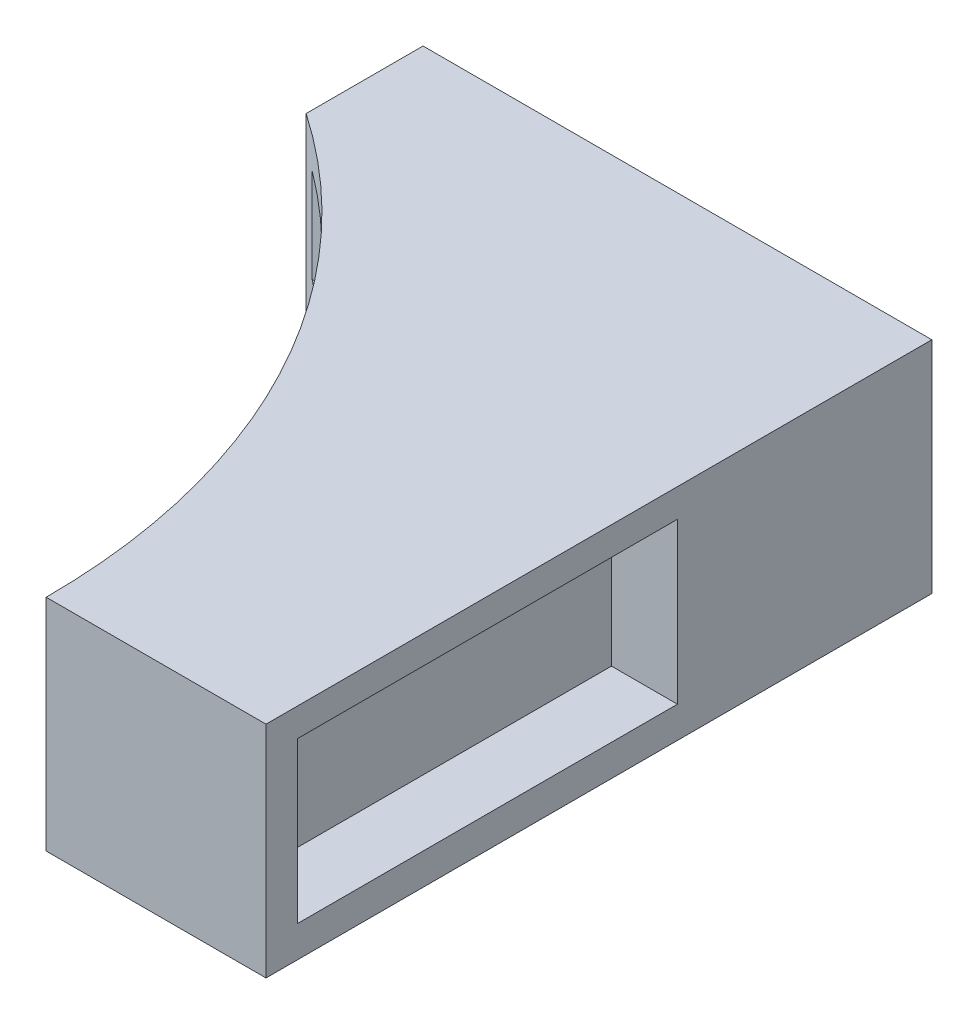
ISO-10303-21;
HEADER;
FILE_DESCRIPTION(('STEP AP214'),'2;1');
FILE_NAME('part.step','',(''),(''),'','','');
FILE_SCHEMA(('AUTOMOTIVE_DESIGN { 1 0 10303 214 1 1 1 1 }'));
ENDSEC;
DATA;
#1=APPLICATION_CONTEXT('core data for automotive mechanical design processes');
#2=APPLICATION_PROTOCOL_DEFINITION('international standard','automotive_design',2000,#1);
#3=PRODUCT_CONTEXT('',#1,'mechanical');
#4=PRODUCT('Part','Part','',(#3));
#5=PRODUCT_RELATED_PRODUCT_CATEGORY('part','',(#4));
#6=PRODUCT_DEFINITION_FORMATION('','',#4);
#7=PRODUCT_DEFINITION_CONTEXT('part definition',#1,'design');
#8=PRODUCT_DEFINITION('design','',#6,#7);
#9=PRODUCT_DEFINITION_SHAPE('','',#8);
#10=(LENGTH_UNIT() NAMED_UNIT(*) SI_UNIT(.MILLI.,.METRE.));
#11=(NAMED_UNIT(*) PLANE_ANGLE_UNIT() SI_UNIT($,.RADIAN.));
#12=(NAMED_UNIT(*) SI_UNIT($,.STERADIAN.) SOLID_ANGLE_UNIT());
#13=UNCERTAINTY_MEASURE_WITH_UNIT(LENGTH_MEASURE(1.E-05),#10,'distance_accuracy_value','');
#14=(GEOMETRIC_REPRESENTATION_CONTEXT(3) GLOBAL_UNCERTAINTY_ASSIGNED_CONTEXT((#13)) GLOBAL_UNIT_ASSIGNED_CONTEXT((#10,
#11,#12)) REPRESENTATION_CONTEXT('',''));
#15=CARTESIAN_POINT('',(0.,0.,0.));
#16=DIRECTION('',(0.,0.,1.));
#17=DIRECTION('',(1.,0.,0.));
#18=AXIS2_PLACEMENT_3D('',#15,#16,#17);
#19=CARTESIAN_POINT('',(-21.2,7.,0.));
#20=DIRECTION('',(0.,-1.,0.));
#21=DIRECTION('',(0.,0.,-1.));
#22=AXIS2_PLACEMENT_3D('',#19,#20,#21);
#23=CYLINDRICAL_SURFACE('',#22,21.2);
#24=CARTESIAN_POINT('',(-21.2,3.,0.));
#25=DIRECTION('',(0.,-1.,0.));
#26=DIRECTION('',(0.,0.,-1.));
#27=AXIS2_PLACEMENT_3D('',#24,#25,#26);
#28=CIRCLE('',#27,21.2);
#29=CARTESIAN_POINT('',(-0.0945504667633247,3.,-2.));
#30=VERTEX_POINT('',#29);
#31=CARTESIAN_POINT('',(-8.5335087731448,3.,-17.));
#32=VERTEX_POINT('',#31);
#33=EDGE_CURVE('E51',#30,#32,#28,.F.);
#34=ORIENTED_EDGE('',*,*,#33,.T.);
#35=DIRECTION('',(0.,-1.,0.));
#36=VECTOR('',#35,1.);
#37=CARTESIAN_POINT('',(-8.5335087731448,7.,-17.));
#38=LINE('',#37,#36);
#39=CARTESIAN_POINT('',(-8.5335087731448,6.,-17.));
#40=VERTEX_POINT('',#39);
#41=EDGE_CURVE('E11',#32,#40,#38,.F.);
#42=ORIENTED_EDGE('',*,*,#41,.T.);
#43=CARTESIAN_POINT('',(-21.2,6.,0.));
#44=DIRECTION('',(0.,1.,0.));
#45=DIRECTION('',(0.,0.,1.));
#46=AXIS2_PLACEMENT_3D('',#43,#44,#45);
#47=CIRCLE('',#46,21.2);
#48=CARTESIAN_POINT('',(-0.0945504667633247,6.,-2.));
#49=VERTEX_POINT('',#48);
#50=EDGE_CURVE('E266',#40,#49,#47,.F.);
#51=ORIENTED_EDGE('',*,*,#50,.T.);
#52=DIRECTION('',(0.,-1.,0.));
#53=VECTOR('',#52,1.);
#54=CARTESIAN_POINT('',(-0.0945504667633247,7.,-2.));
#55=LINE('',#54,#53);
#56=EDGE_CURVE('E270',#49,#30,#55,.T.);
#57=ORIENTED_EDGE('',*,*,#56,.T.);
#58=EDGE_LOOP('',(#34,#42,#51,#57));
#59=FACE_BOUND('',#58,.T.);
#60=CARTESIAN_POINT('',(-21.2,7.,0.));
#61=DIRECTION('',(0.,-1.,0.));
#62=DIRECTION('',(0.,0.,-1.));
#63=AXIS2_PLACEMENT_3D('',#60,#61,#62);
#64=CIRCLE('',#63,21.2);
#65=CARTESIAN_POINT('',(-9.2,7.,-17.4768418199628));
#66=VERTEX_POINT('',#65);
#67=CARTESIAN_POINT('',(0.,7.,0.));
#68=VERTEX_POINT('',#67);
#69=EDGE_CURVE('E229',#66,#68,#64,.T.);
#70=ORIENTED_EDGE('',*,*,#69,.F.);
#71=DIRECTION('',(0.,1.,0.));
#72=VECTOR('',#71,1.);
#73=CARTESIAN_POINT('',(-9.2,0.,-17.4768418199628));
#74=LINE('',#73,#72);
#75=CARTESIAN_POINT('',(-9.2,0.,-17.4768418199628));
#76=VERTEX_POINT('',#75);
#77=EDGE_CURVE('E219',#76,#66,#74,.T.);
#78=ORIENTED_EDGE('',*,*,#77,.F.);
#79=CARTESIAN_POINT('',(-21.2,0.,0.));
#80=DIRECTION('',(0.,-1.,0.));
#81=DIRECTION('',(0.,0.,-1.));
#82=AXIS2_PLACEMENT_3D('',#79,#80,#81);
#83=CIRCLE('',#82,21.2);
#84=CARTESIAN_POINT('',(0.,0.,0.));
#85=VERTEX_POINT('',#84);
#86=EDGE_CURVE('E226',#76,#85,#83,.T.);
#87=ORIENTED_EDGE('',*,*,#86,.T.);
#88=DIRECTION('',(0.,-1.,0.));
#89=VECTOR('',#88,1.);
#90=CARTESIAN_POINT('',(0.,7.,0.));
#91=LINE('',#90,#89);
#92=EDGE_CURVE('E262',#68,#85,#91,.T.);
#93=ORIENTED_EDGE('',*,*,#92,.F.);
#94=EDGE_LOOP('',(#70,#78,#87,#93));
#95=FACE_BOUND('',#94,.T.);
#96=ADVANCED_FACE('F43',(#59,#95),#23,.F.);
#97=CARTESIAN_POINT('',(0.,7.,0.));
#98=DIRECTION('',(0.,0.,-1.));
#99=DIRECTION('',(-1.,0.,0.));
#100=AXIS2_PLACEMENT_3D('',#97,#98,#99);
#101=PLANE('',#100);
#102=DIRECTION('',(1.,0.,0.));
#103=VECTOR('',#102,1.);
#104=CARTESIAN_POINT('',(0.,0.,0.));
#105=LINE('',#104,#103);
#106=CARTESIAN_POINT('',(7.,0.,0.));
#107=VERTEX_POINT('',#106);
#108=EDGE_CURVE('E246',#85,#107,#105,.T.);
#109=ORIENTED_EDGE('',*,*,#108,.T.);
#110=DIRECTION('',(0.,-1.,0.));
#111=VECTOR('',#110,1.);
#112=CARTESIAN_POINT('',(7.,7.,0.));
#113=LINE('',#112,#111);
#114=CARTESIAN_POINT('',(7.,7.,0.));
#115=VERTEX_POINT('',#114);
#116=EDGE_CURVE('E258',#115,#107,#113,.T.);
#117=ORIENTED_EDGE('',*,*,#116,.F.);
#118=DIRECTION('',(1.,0.,0.));
#119=VECTOR('',#118,1.);
#120=CARTESIAN_POINT('',(0.,7.,0.));
#121=LINE('',#120,#119);
#122=EDGE_CURVE('E232',#68,#115,#121,.T.);
#123=ORIENTED_EDGE('',*,*,#122,.F.);
#124=ORIENTED_EDGE('',*,*,#92,.T.);
#125=EDGE_LOOP('',(#109,#117,#123,#124));
#126=FACE_BOUND('',#125,.T.);
#127=ADVANCED_FACE('F303',(#126),#101,.F.);
#128=CARTESIAN_POINT('',(7.,7.,0.));
#129=DIRECTION('',(-1.,0.,0.));
#130=DIRECTION('',(0.,0.,1.));
#131=AXIS2_PLACEMENT_3D('',#128,#129,#130);
#132=PLANE('',#131);
#133=DIRECTION('',(0.,0.,-1.));
#134=VECTOR('',#133,1.);
#135=CARTESIAN_POINT('',(7.,1.,-1.));
#136=LINE('',#135,#134);
#137=CARTESIAN_POINT('',(7.,1.,-1.));
#138=VERTEX_POINT('',#137);
#139=CARTESIAN_POINT('',(7.,1.,-13.1));
#140=VERTEX_POINT('',#139);
#141=EDGE_CURVE('E174',#138,#140,#136,.T.);
#142=ORIENTED_EDGE('',*,*,#141,.F.);
#143=DIRECTION('',(0.,-1.,0.));
#144=VECTOR('',#143,1.);
#145=CARTESIAN_POINT('',(7.,1.,-1.));
#146=LINE('',#145,#144);
#147=CARTESIAN_POINT('',(7.,6.1,-1.));
#148=VERTEX_POINT('',#147);
#149=EDGE_CURVE('E58',#148,#138,#146,.T.);
#150=ORIENTED_EDGE('',*,*,#149,.F.);
#151=DIRECTION('',(0.,0.,1.));
#152=VECTOR('',#151,1.);
#153=CARTESIAN_POINT('',(7.,6.1,-1.));
#154=LINE('',#153,#152);
#155=CARTESIAN_POINT('',(7.,6.1,-13.1));
#156=VERTEX_POINT('',#155);
#157=EDGE_CURVE('E161',#156,#148,#154,.T.);
#158=ORIENTED_EDGE('',*,*,#157,.F.);
#159=DIRECTION('',(0.,1.,0.));
#160=VECTOR('',#159,1.);
#161=CARTESIAN_POINT('',(7.,1.,-13.1));
#162=LINE('',#161,#160);
#163=EDGE_CURVE('E165',#140,#156,#162,.T.);
#164=ORIENTED_EDGE('',*,*,#163,.F.);
#165=EDGE_LOOP('',(#142,#150,#158,#164));
#166=FACE_BOUND('',#165,.T.);
#167=DIRECTION('',(0.,0.,-1.));
#168=VECTOR('',#167,1.);
#169=CARTESIAN_POINT('',(7.,0.,0.));
#170=LINE('',#169,#168);
#171=CARTESIAN_POINT('',(7.,0.,-21.2));
#172=VERTEX_POINT('',#171);
#173=EDGE_CURVE('E249',#107,#172,#170,.T.);
#174=ORIENTED_EDGE('',*,*,#173,.T.);
#175=DIRECTION('',(0.,-1.,0.));
#176=VECTOR('',#175,1.);
#177=CARTESIAN_POINT('',(7.,7.,-21.2));
#178=LINE('',#177,#176);
#179=CARTESIAN_POINT('',(7.,7.,-21.2));
#180=VERTEX_POINT('',#179);
#181=EDGE_CURVE('E243',#180,#172,#178,.T.);
#182=ORIENTED_EDGE('',*,*,#181,.F.);
#183=DIRECTION('',(0.,0.,-1.));
#184=VECTOR('',#183,1.);
#185=CARTESIAN_POINT('',(7.,7.,0.));
#186=LINE('',#185,#184);
#187=EDGE_CURVE('E236',#115,#180,#186,.T.);
#188=ORIENTED_EDGE('',*,*,#187,.F.);
#189=ORIENTED_EDGE('',*,*,#116,.T.);
#190=EDGE_LOOP('',(#174,#182,#188,#189));
#191=FACE_BOUND('',#190,.T.);
#192=ADVANCED_FACE('F307',(#166,#191),#132,.F.);
#193=CARTESIAN_POINT('',(7.,7.,-21.2));
#194=DIRECTION('',(0.,0.,1.));
#195=DIRECTION('',(1.,0.,0.));
#196=AXIS2_PLACEMENT_3D('',#193,#194,#195);
#197=PLANE('',#196);
#198=DIRECTION('',(-1.,0.,0.));
#199=VECTOR('',#198,1.);
#200=CARTESIAN_POINT('',(7.,0.,-21.2));
#201=LINE('',#200,#199);
#202=CARTESIAN_POINT('',(-9.2,0.,-21.2));
#203=VERTEX_POINT('',#202);
#204=EDGE_CURVE('E233',#172,#203,#201,.T.);
#205=ORIENTED_EDGE('',*,*,#204,.T.);
#206=DIRECTION('',(0.,1.,0.));
#207=VECTOR('',#206,1.);
#208=CARTESIAN_POINT('',(-9.2,0.,-21.2));
#209=LINE('',#208,#207);
#210=CARTESIAN_POINT('',(-9.2,7.,-21.2));
#211=VERTEX_POINT('',#210);
#212=EDGE_CURVE('E222',#203,#211,#209,.T.);
#213=ORIENTED_EDGE('',*,*,#212,.T.);
#214=DIRECTION('',(-1.,0.,0.));
#215=VECTOR('',#214,1.);
#216=CARTESIAN_POINT('',(7.,7.,-21.2));
#217=LINE('',#216,#215);
#218=EDGE_CURVE('E239',#180,#211,#217,.T.);
#219=ORIENTED_EDGE('',*,*,#218,.F.);
#220=ORIENTED_EDGE('',*,*,#181,.T.);
#221=EDGE_LOOP('',(#205,#213,#219,#220));
#222=FACE_BOUND('',#221,.T.);
#223=ADVANCED_FACE('F312',(#222),#197,.F.);
#224=CARTESIAN_POINT('',(-21.2,7.,0.));
#225=DIRECTION('',(0.,-1.,0.));
#226=DIRECTION('',(0.,0.,-1.));
#227=AXIS2_PLACEMENT_3D('',#224,#225,#226);
#228=PLANE('',#227);
#229=ORIENTED_EDGE('',*,*,#218,.T.);
#230=DIRECTION('',(0.,0.,-1.));
#231=VECTOR('',#230,1.);
#232=CARTESIAN_POINT('',(-9.2,7.,-17.4768418199628));
#233=LINE('',#232,#231);
#234=EDGE_CURVE('E207',#66,#211,#233,.T.);
#235=ORIENTED_EDGE('',*,*,#234,.F.);
#236=ORIENTED_EDGE('',*,*,#69,.T.);
#237=ORIENTED_EDGE('',*,*,#122,.T.);
#238=ORIENTED_EDGE('',*,*,#187,.T.);
#239=EDGE_LOOP('',(#229,#235,#236,#237,#238));
#240=FACE_BOUND('',#239,.T.);
#241=ADVANCED_FACE('F318',(#240),#228,.F.);
#242=CARTESIAN_POINT('',(-21.2,0.,0.));
#243=DIRECTION('',(0.,-1.,0.));
#244=DIRECTION('',(0.,0.,-1.));
#245=AXIS2_PLACEMENT_3D('',#242,#243,#244);
#246=PLANE('',#245);
#247=DIRECTION('',(0.,0.,-1.));
#248=VECTOR('',#247,1.);
#249=CARTESIAN_POINT('',(-9.2,0.,-17.4768418199628));
#250=LINE('',#249,#248);
#251=EDGE_CURVE('E215',#76,#203,#250,.T.);
#252=ORIENTED_EDGE('',*,*,#251,.T.);
#253=ORIENTED_EDGE('',*,*,#204,.F.);
#254=ORIENTED_EDGE('',*,*,#173,.F.);
#255=ORIENTED_EDGE('',*,*,#108,.F.);
#256=ORIENTED_EDGE('',*,*,#86,.F.);
#257=EDGE_LOOP('',(#252,#253,#254,#255,#256));
#258=FACE_BOUND('',#257,.T.);
#259=ADVANCED_FACE('F320',(#258),#246,.T.);
#260=CARTESIAN_POINT('',(-9.2,0.,-17.4768418199628));
#261=DIRECTION('',(1.,0.,0.));
#262=DIRECTION('',(0.,0.,-1.));
#263=AXIS2_PLACEMENT_3D('',#260,#261,#262);
#264=PLANE('',#263);
#265=ORIENTED_EDGE('',*,*,#234,.T.);
#266=ORIENTED_EDGE('',*,*,#212,.F.);
#267=ORIENTED_EDGE('',*,*,#251,.F.);
#268=ORIENTED_EDGE('',*,*,#77,.T.);
#269=EDGE_LOOP('',(#265,#266,#267,#268));
#270=FACE_BOUND('',#269,.T.);
#271=ADVANCED_FACE('F323',(#270),#264,.F.);
#272=CARTESIAN_POINT('',(-10.,6.,-17.));
#273=DIRECTION('',(0.,0.,-1.));
#274=DIRECTION('',(-1.,0.,0.));
#275=AXIS2_PLACEMENT_3D('',#272,#273,#274);
#276=PLANE('',#275);
#277=DIRECTION('',(1.,0.,0.));
#278=VECTOR('',#277,1.);
#279=CARTESIAN_POINT('',(-10.,3.,-17.));
#280=LINE('',#279,#278);
#281=CARTESIAN_POINT('',(0.,3.,-17.));
#282=VERTEX_POINT('',#281);
#283=EDGE_CURVE('E204',#32,#282,#280,.T.);
#284=ORIENTED_EDGE('',*,*,#283,.T.);
#285=DIRECTION('',(0.,1.,0.));
#286=VECTOR('',#285,1.);
#287=CARTESIAN_POINT('',(0.,6.,-17.));
#288=LINE('',#287,#286);
#289=CARTESIAN_POINT('',(0.,6.,-17.));
#290=VERTEX_POINT('',#289);
#291=EDGE_CURVE('E183',#282,#290,#288,.T.);
#292=ORIENTED_EDGE('',*,*,#291,.T.);
#293=DIRECTION('',(1.,0.,0.));
#294=VECTOR('',#293,1.);
#295=CARTESIAN_POINT('',(-10.,6.,-17.));
#296=LINE('',#295,#294);
#297=EDGE_CURVE('E203',#40,#290,#296,.T.);
#298=ORIENTED_EDGE('',*,*,#297,.F.);
#299=ORIENTED_EDGE('',*,*,#41,.F.);
#300=EDGE_LOOP('',(#284,#292,#298,#299));
#301=FACE_BOUND('',#300,.T.);
#302=ADVANCED_FACE('F291',(#301),#276,.F.);
#303=CARTESIAN_POINT('',(-10.,3.,-17.));
#304=DIRECTION('',(0.,-1.,0.));
#305=DIRECTION('',(0.,0.,-1.));
#306=AXIS2_PLACEMENT_3D('',#303,#304,#305);
#307=PLANE('',#306);
#308=DIRECTION('',(1.,0.,0.));
#309=VECTOR('',#308,1.);
#310=CARTESIAN_POINT('',(-10.,3.,-2.));
#311=LINE('',#310,#309);
#312=CARTESIAN_POINT('',(0.,3.,-2.));
#313=VERTEX_POINT('',#312);
#314=EDGE_CURVE('E208',#30,#313,#311,.T.);
#315=ORIENTED_EDGE('',*,*,#314,.T.);
#316=DIRECTION('',(0.,0.,-1.));
#317=VECTOR('',#316,1.);
#318=CARTESIAN_POINT('',(0.,3.,-17.));
#319=LINE('',#318,#317);
#320=EDGE_CURVE('E199',#313,#282,#319,.T.);
#321=ORIENTED_EDGE('',*,*,#320,.T.);
#322=ORIENTED_EDGE('',*,*,#283,.F.);
#323=ORIENTED_EDGE('',*,*,#33,.F.);
#324=EDGE_LOOP('',(#315,#321,#322,#323));
#325=FACE_BOUND('',#324,.T.);
#326=ADVANCED_FACE('F280',(#325),#307,.F.);
#327=CARTESIAN_POINT('',(-10.,6.,-2.));
#328=DIRECTION('',(0.,0.,1.));
#329=DIRECTION('',(1.,0.,0.));
#330=AXIS2_PLACEMENT_3D('',#327,#328,#329);
#331=PLANE('',#330);
#332=DIRECTION('',(1.,0.,0.));
#333=VECTOR('',#332,1.);
#334=CARTESIAN_POINT('',(-10.,6.,-2.));
#335=LINE('',#334,#333);
#336=CARTESIAN_POINT('',(0.,6.,-2.));
#337=VERTEX_POINT('',#336);
#338=EDGE_CURVE('E66',#49,#337,#335,.T.);
#339=ORIENTED_EDGE('',*,*,#338,.T.);
#340=DIRECTION('',(0.,-1.,0.));
#341=VECTOR('',#340,1.);
#342=CARTESIAN_POINT('',(0.,6.,-2.));
#343=LINE('',#342,#341);
#344=EDGE_CURVE('E195',#337,#313,#343,.T.);
#345=ORIENTED_EDGE('',*,*,#344,.T.);
#346=ORIENTED_EDGE('',*,*,#314,.F.);
#347=ORIENTED_EDGE('',*,*,#56,.F.);
#348=EDGE_LOOP('',(#339,#345,#346,#347));
#349=FACE_BOUND('',#348,.T.);
#350=ADVANCED_FACE('F282',(#349),#331,.F.);
#351=CARTESIAN_POINT('',(-10.,6.,-17.));
#352=DIRECTION('',(0.,1.,0.));
#353=DIRECTION('',(0.,0.,1.));
#354=AXIS2_PLACEMENT_3D('',#351,#352,#353);
#355=PLANE('',#354);
#356=ORIENTED_EDGE('',*,*,#297,.T.);
#357=DIRECTION('',(0.,0.,1.));
#358=VECTOR('',#357,1.);
#359=CARTESIAN_POINT('',(0.,6.,-17.));
#360=LINE('',#359,#358);
#361=EDGE_CURVE('E192',#290,#337,#360,.T.);
#362=ORIENTED_EDGE('',*,*,#361,.T.);
#363=ORIENTED_EDGE('',*,*,#338,.F.);
#364=ORIENTED_EDGE('',*,*,#50,.F.);
#365=EDGE_LOOP('',(#356,#362,#363,#364));
#366=FACE_BOUND('',#365,.T.);
#367=ADVANCED_FACE('F292',(#366),#355,.F.);
#368=CARTESIAN_POINT('',(0.,0.,0.));
#369=DIRECTION('',(-1.,0.,0.));
#370=DIRECTION('',(0.,0.,1.));
#371=AXIS2_PLACEMENT_3D('',#368,#369,#370);
#372=PLANE('',#371);
#373=ORIENTED_EDGE('',*,*,#291,.F.);
#374=ORIENTED_EDGE('',*,*,#320,.F.);
#375=ORIENTED_EDGE('',*,*,#344,.F.);
#376=ORIENTED_EDGE('',*,*,#361,.F.);
#377=EDGE_LOOP('',(#373,#374,#375,#376));
#378=FACE_BOUND('',#377,.T.);
#379=ADVANCED_FACE('F288',(#378),#372,.T.);
#380=CARTESIAN_POINT('',(4.9,1.,-1.));
#381=DIRECTION('',(0.,0.,1.));
#382=DIRECTION('',(0.,-1.,0.));
#383=AXIS2_PLACEMENT_3D('',#380,#381,#382);
#384=PLANE('',#383);
#385=ORIENTED_EDGE('',*,*,#149,.T.);
#386=DIRECTION('',(1.,0.,0.));
#387=VECTOR('',#386,1.);
#388=CARTESIAN_POINT('',(4.9,1.,-1.));
#389=LINE('',#388,#387);
#390=CARTESIAN_POINT('',(4.9,1.,-1.));
#391=VERTEX_POINT('',#390);
#392=EDGE_CURVE('E136',#391,#138,#389,.T.);
#393=ORIENTED_EDGE('',*,*,#392,.F.);
#394=DIRECTION('',(0.,-1.,0.));
#395=VECTOR('',#394,1.);
#396=CARTESIAN_POINT('',(4.9,1.,-1.));
#397=LINE('',#396,#395);
#398=CARTESIAN_POINT('',(4.9,6.1,-1.));
#399=VERTEX_POINT('',#398);
#400=EDGE_CURVE('E140',#399,#391,#397,.T.);
#401=ORIENTED_EDGE('',*,*,#400,.F.);
#402=DIRECTION('',(1.,0.,0.));
#403=VECTOR('',#402,1.);
#404=CARTESIAN_POINT('',(4.9,6.1,-1.));
#405=LINE('',#404,#403);
#406=EDGE_CURVE('E180',#399,#148,#405,.T.);
#407=ORIENTED_EDGE('',*,*,#406,.T.);
#408=EDGE_LOOP('',(#385,#393,#401,#407));
#409=FACE_BOUND('',#408,.T.);
#410=ADVANCED_FACE('F138',(#409),#384,.F.);
#411=CARTESIAN_POINT('',(4.9,6.1,-1.));
#412=DIRECTION('',(0.,1.,0.));
#413=DIRECTION('',(0.,0.,1.));
#414=AXIS2_PLACEMENT_3D('',#411,#412,#413);
#415=PLANE('',#414);
#416=ORIENTED_EDGE('',*,*,#157,.T.);
#417=ORIENTED_EDGE('',*,*,#406,.F.);
#418=DIRECTION('',(0.,0.,1.));
#419=VECTOR('',#418,1.);
#420=CARTESIAN_POINT('',(4.9,6.1,-1.));
#421=LINE('',#420,#419);
#422=CARTESIAN_POINT('',(4.9,6.1,-13.1));
#423=VERTEX_POINT('',#422);
#424=EDGE_CURVE('E147',#423,#399,#421,.T.);
#425=ORIENTED_EDGE('',*,*,#424,.F.);
#426=DIRECTION('',(1.,0.,0.));
#427=VECTOR('',#426,1.);
#428=CARTESIAN_POINT('',(4.9,6.1,-13.1));
#429=LINE('',#428,#427);
#430=EDGE_CURVE('E184',#423,#156,#429,.T.);
#431=ORIENTED_EDGE('',*,*,#430,.T.);
#432=EDGE_LOOP('',(#416,#417,#425,#431));
#433=FACE_BOUND('',#432,.T.);
#434=ADVANCED_FACE('F340',(#433),#415,.F.);
#435=CARTESIAN_POINT('',(4.9,1.,-13.1));
#436=DIRECTION('',(0.,0.,-1.));
#437=DIRECTION('',(-1.,0.,0.));
#438=AXIS2_PLACEMENT_3D('',#435,#436,#437);
#439=PLANE('',#438);
#440=ORIENTED_EDGE('',*,*,#163,.T.);
#441=ORIENTED_EDGE('',*,*,#430,.F.);
#442=DIRECTION('',(0.,1.,0.));
#443=VECTOR('',#442,1.);
#444=CARTESIAN_POINT('',(4.9,1.,-13.1));
#445=LINE('',#444,#443);
#446=CARTESIAN_POINT('',(4.9,1.,-13.1));
#447=VERTEX_POINT('',#446);
#448=EDGE_CURVE('E156',#447,#423,#445,.T.);
#449=ORIENTED_EDGE('',*,*,#448,.F.);
#450=DIRECTION('',(1.,0.,0.));
#451=VECTOR('',#450,1.);
#452=CARTESIAN_POINT('',(4.9,1.,-13.1));
#453=LINE('',#452,#451);
#454=EDGE_CURVE('E146',#447,#140,#453,.T.);
#455=ORIENTED_EDGE('',*,*,#454,.T.);
#456=EDGE_LOOP('',(#440,#441,#449,#455));
#457=FACE_BOUND('',#456,.T.);
#458=ADVANCED_FACE('F343',(#457),#439,.F.);
#459=CARTESIAN_POINT('',(4.9,1.,-1.));
#460=DIRECTION('',(0.,-1.,0.));
#461=DIRECTION('',(0.,0.,-1.));
#462=AXIS2_PLACEMENT_3D('',#459,#460,#461);
#463=PLANE('',#462);
#464=ORIENTED_EDGE('',*,*,#141,.T.);
#465=ORIENTED_EDGE('',*,*,#454,.F.);
#466=DIRECTION('',(0.,0.,-1.));
#467=VECTOR('',#466,1.);
#468=CARTESIAN_POINT('',(4.9,1.,-1.));
#469=LINE('',#468,#467);
#470=EDGE_CURVE('E150',#391,#447,#469,.T.);
#471=ORIENTED_EDGE('',*,*,#470,.F.);
#472=ORIENTED_EDGE('',*,*,#392,.T.);
#473=EDGE_LOOP('',(#464,#465,#471,#472));
#474=FACE_BOUND('',#473,.T.);
#475=ADVANCED_FACE('F151',(#474),#463,.F.);
#476=CARTESIAN_POINT('',(4.9,0.,0.));
#477=DIRECTION('',(-1.,0.,0.));
#478=DIRECTION('',(0.,0.,1.));
#479=AXIS2_PLACEMENT_3D('',#476,#477,#478);
#480=PLANE('',#479);
#481=ORIENTED_EDGE('',*,*,#400,.T.);
#482=ORIENTED_EDGE('',*,*,#470,.T.);
#483=ORIENTED_EDGE('',*,*,#448,.T.);
#484=ORIENTED_EDGE('',*,*,#424,.T.);
#485=EDGE_LOOP('',(#481,#482,#483,#484));
#486=FACE_BOUND('',#485,.T.);
#487=ADVANCED_FACE('F158',(#486),#480,.F.);
#488=CLOSED_SHELL('',(#96,#127,#192,#223,#241,#259,#271,#302,#326,#350,#367,#379,#410,#434,#458,
#475,#487));
#489=MANIFOLD_SOLID_BREP('B2',#488);
#490=ADVANCED_BREP_SHAPE_REPRESENTATION('',(#18,#489),#14);
#491=SHAPE_DEFINITION_REPRESENTATION(#9,#490);
ENDSEC;
END-ISO-10303-21;
